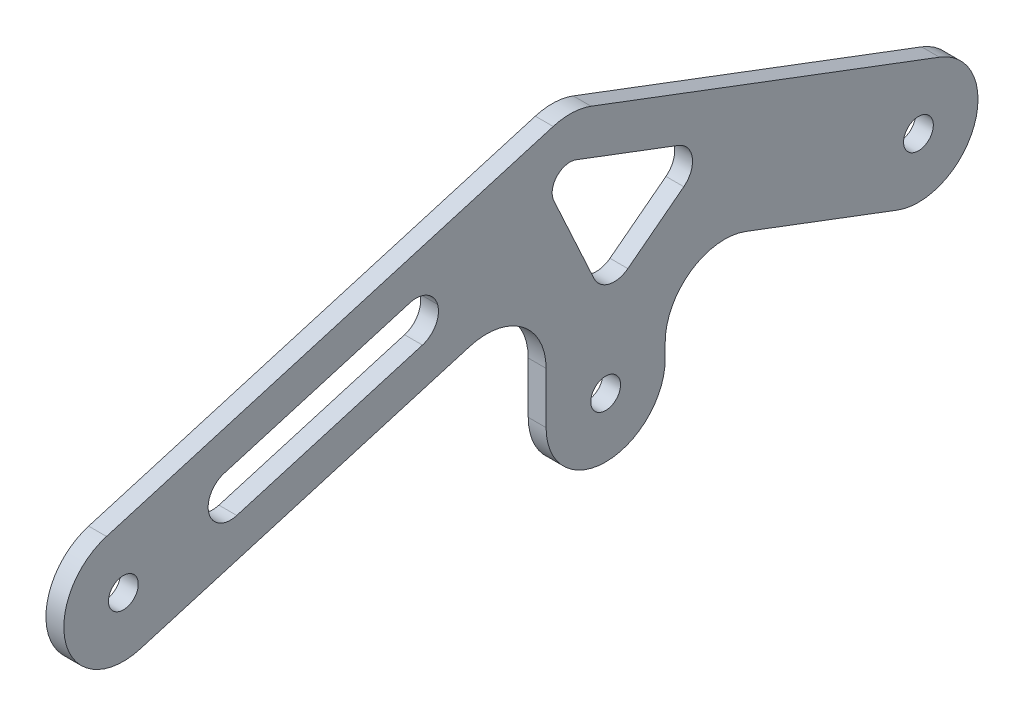
ISO-10303-21;
HEADER;
FILE_DESCRIPTION(('STEP AP214'),'2;1');
FILE_NAME('part.step','',(''),(''),'','','');
FILE_SCHEMA(('AUTOMOTIVE_DESIGN { 1 0 10303 214 1 1 1 1 }'));
ENDSEC;
DATA;
#1=APPLICATION_CONTEXT('core data for automotive mechanical design processes');
#2=APPLICATION_PROTOCOL_DEFINITION('international standard','automotive_design',2000,#1);
#3=PRODUCT_CONTEXT('',#1,'mechanical');
#4=PRODUCT('Part','Part','',(#3));
#5=PRODUCT_RELATED_PRODUCT_CATEGORY('part','',(#4));
#6=PRODUCT_DEFINITION_FORMATION('','',#4);
#7=PRODUCT_DEFINITION_CONTEXT('part definition',#1,'design');
#8=PRODUCT_DEFINITION('design','',#6,#7);
#9=PRODUCT_DEFINITION_SHAPE('','',#8);
#10=(LENGTH_UNIT() NAMED_UNIT(*) SI_UNIT(.MILLI.,.METRE.));
#11=(NAMED_UNIT(*) PLANE_ANGLE_UNIT() SI_UNIT($,.RADIAN.));
#12=(NAMED_UNIT(*) SI_UNIT($,.STERADIAN.) SOLID_ANGLE_UNIT());
#13=UNCERTAINTY_MEASURE_WITH_UNIT(LENGTH_MEASURE(1.E-05),#10,'distance_accuracy_value','');
#14=(GEOMETRIC_REPRESENTATION_CONTEXT(3) GLOBAL_UNCERTAINTY_ASSIGNED_CONTEXT((#13)) GLOBAL_UNIT_ASSIGNED_CONTEXT((#10,
#11,#12)) REPRESENTATION_CONTEXT('',''));
#15=CARTESIAN_POINT('',(0.,0.,0.));
#16=DIRECTION('',(0.,0.,1.));
#17=DIRECTION('',(1.,0.,0.));
#18=AXIS2_PLACEMENT_3D('',#15,#16,#17);
#19=CARTESIAN_POINT('',(3.,-1.49353266513425,-90.9802292545983));
#20=DIRECTION('',(1.,0.,0.));
#21=DIRECTION('',(0.,0.,-1.));
#22=AXIS2_PLACEMENT_3D('',#19,#20,#21);
#23=PLANE('',#22);
#24=CARTESIAN_POINT('',(3.,10.,-10.));
#25=DIRECTION('',(1.,0.,0.));
#26=DIRECTION('',(0.,0.,-1.));
#27=AXIS2_PLACEMENT_3D('',#24,#25,#26);
#28=CIRCLE('',#27,2.5);
#29=CARTESIAN_POINT('',(3.,10.,-12.5));
#30=VERTEX_POINT('',#29);
#31=EDGE_CURVE('E263',#30,#30,#28,.T.);
#32=ORIENTED_EDGE('',*,*,#31,.F.);
#33=EDGE_LOOP('',(#32));
#34=FACE_BOUND('',#33,.T.);
#35=DIRECTION('',(0.,0.282841783069722,-0.959166578728607));
#36=VECTOR('',#35,1.);
#37=CARTESIAN_POINT('',(3.,0.408334212721614,-12.8284178306949));
#38=LINE('',#37,#36);
#39=CARTESIAN_POINT('',(3.,0.408334212721614,-12.8284178306949));
#40=VERTEX_POINT('',#39);
#41=CARTESIAN_POINT('',(3.,16.7222546895087,-68.1518114239011));
#42=VERTEX_POINT('',#41);
#43=EDGE_CURVE('E300',#40,#42,#38,.T.);
#44=ORIENTED_EDGE('',*,*,#43,.T.);
#45=CARTESIAN_POINT('',(3.,7.13058890222264,-70.9802292545983));
#46=DIRECTION('',(1.,0.,0.));
#47=DIRECTION('',(0.,0.,-1.));
#48=AXIS2_PLACEMENT_3D('',#45,#46,#47);
#49=CIRCLE('',#48,10.);
#50=CARTESIAN_POINT('',(3.,7.13058890222264,-80.9802292545983));
#51=VERTEX_POINT('',#50);
#52=EDGE_CURVE('E235',#42,#51,#49,.F.);
#53=ORIENTED_EDGE('',*,*,#52,.T.);
#54=DIRECTION('',(0.,-1.,0.));
#55=VECTOR('',#54,1.);
#56=CARTESIAN_POINT('',(3.,20.5051352169009,-80.9802292545983));
#57=LINE('',#56,#55);
#58=CARTESIAN_POINT('',(3.,-1.49353266513425,-80.9802292545983));
#59=VERTEX_POINT('',#58);
#60=EDGE_CURVE('E271',#51,#59,#57,.T.);
#61=ORIENTED_EDGE('',*,*,#60,.T.);
#62=CARTESIAN_POINT('',(3.,-1.49353266513425,-90.9802292545983));
#63=DIRECTION('',(1.,0.,0.));
#64=DIRECTION('',(0.,0.,-1.));
#65=AXIS2_PLACEMENT_3D('',#62,#63,#64);
#66=CIRCLE('',#65,9.99999999999999);
#67=CARTESIAN_POINT('',(3.,-1.49353266513425,-100.980229254598));
#68=VERTEX_POINT('',#67);
#69=EDGE_CURVE('E274',#59,#68,#66,.T.);
#70=ORIENTED_EDGE('',*,*,#69,.T.);
#71=DIRECTION('',(0.,1.,0.));
#72=VECTOR('',#71,1.);
#73=CARTESIAN_POINT('',(3.,15.3840401127578,-100.980229254598));
#74=LINE('',#73,#72);
#75=CARTESIAN_POINT('',(3.,0.912721051605862,-100.980229254598));
#76=VERTEX_POINT('',#75);
#77=EDGE_CURVE('E278',#68,#76,#74,.T.);
#78=ORIENTED_EDGE('',*,*,#77,.T.);
#79=CARTESIAN_POINT('',(3.,0.912721051605853,-110.980229254598));
#80=DIRECTION('',(1.,0.,0.));
#81=DIRECTION('',(0.,0.,-1.));
#82=AXIS2_PLACEMENT_3D('',#79,#80,#81);
#83=CIRCLE('',#82,10.);
#84=CARTESIAN_POINT('',(3.,10.2665846063096,-114.516503650058));
#85=VERTEX_POINT('',#84);
#86=EDGE_CURVE('E383',#76,#85,#83,.F.);
#87=ORIENTED_EDGE('',*,*,#86,.T.);
#88=DIRECTION('',(0.,-0.353627439545988,-0.935386355470374));
#89=VECTOR('',#88,1.);
#90=CARTESIAN_POINT('',(3.,15.3840401127578,-100.980229254598));
#91=LINE('',#90,#89);
#92=CARTESIAN_POINT('',(3.,0.64613644529626,-139.96372560454));
#93=VERTEX_POINT('',#92);
#94=EDGE_CURVE('E282',#85,#93,#91,.T.);
#95=ORIENTED_EDGE('',*,*,#94,.T.);
#96=CARTESIAN_POINT('',(3.,10.,-143.5));
#97=DIRECTION('',(1.,0.,0.));
#98=DIRECTION('',(0.,0.,-1.));
#99=AXIS2_PLACEMENT_3D('',#96,#97,#98);
#100=CIRCLE('',#99,10.);
#101=CARTESIAN_POINT('',(3.,19.3538635547037,-147.03627439546));
#102=VERTEX_POINT('',#101);
#103=EDGE_CURVE('E285',#93,#102,#100,.T.);
#104=ORIENTED_EDGE('',*,*,#103,.T.);
#105=DIRECTION('',(0.,0.353627439545988,0.935386355470374));
#106=VECTOR('',#105,1.);
#107=CARTESIAN_POINT('',(3.,19.3538635547037,-147.03627439546));
#108=LINE('',#107,#106);
#109=CARTESIAN_POINT('',(3.,41.4700779857315,-88.5362743954599));
#110=VERTEX_POINT('',#109);
#111=EDGE_CURVE('E288',#102,#110,#108,.T.);
#112=ORIENTED_EDGE('',*,*,#111,.T.);
#113=CARTESIAN_POINT('',(3.,32.1162144310277,-85.));
#114=DIRECTION('',(1.,0.,0.));
#115=DIRECTION('',(0.,0.,-1.));
#116=AXIS2_PLACEMENT_3D('',#113,#114,#115);
#117=CIRCLE('',#116,9.99999999999999);
#118=CARTESIAN_POINT('',(3.,41.7078802183132,-82.1715821693008));
#119=VERTEX_POINT('',#118);
#120=EDGE_CURVE('E291',#110,#119,#117,.T.);
#121=ORIENTED_EDGE('',*,*,#120,.T.);
#122=DIRECTION('',(0.,-0.282841783069918,0.959166578728549));
#123=VECTOR('',#122,1.);
#124=CARTESIAN_POINT('',(3.,19.5916657872778,-7.17158216930308));
#125=LINE('',#124,#123);
#126=CARTESIAN_POINT('',(3.,19.5916657872778,-7.17158216930308));
#127=VERTEX_POINT('',#126);
#128=EDGE_CURVE('E294',#119,#127,#125,.T.);
#129=ORIENTED_EDGE('',*,*,#128,.T.);
#130=CARTESIAN_POINT('',(3.,10.,-10.));
#131=DIRECTION('',(1.,0.,0.));
#132=DIRECTION('',(0.,0.,-1.));
#133=AXIS2_PLACEMENT_3D('',#130,#131,#132);
#134=CIRCLE('',#133,9.99999999999199);
#135=EDGE_CURVE('E297',#127,#40,#134,.T.);
#136=ORIENTED_EDGE('',*,*,#135,.T.);
#137=EDGE_LOOP('',(#44,#53,#61,#70,#78,#87,#95,#104,#112,#121,#129,#136));
#138=FACE_BOUND('',#137,.T.);
#139=CARTESIAN_POINT('',(3.,10.,-143.5));
#140=DIRECTION('',(1.,0.,0.));
#141=DIRECTION('',(0.,0.,-1.));
#142=AXIS2_PLACEMENT_3D('',#139,#140,#141);
#143=CIRCLE('',#142,2.5);
#144=CARTESIAN_POINT('',(3.,10.,-146.));
#145=VERTEX_POINT('',#144);
#146=EDGE_CURVE('E255',#145,#145,#143,.T.);
#147=ORIENTED_EDGE('',*,*,#146,.F.);
#148=EDGE_LOOP('',(#147));
#149=FACE_BOUND('',#148,.T.);
#150=CARTESIAN_POINT('',(3.,-1.49353266513425,-90.9802292545983));
#151=DIRECTION('',(1.,0.,0.));
#152=DIRECTION('',(0.,0.,-1.));
#153=AXIS2_PLACEMENT_3D('',#150,#151,#152);
#154=CIRCLE('',#153,2.49999999999999);
#155=CARTESIAN_POINT('',(3.,-1.49353266513425,-93.4802292545983));
#156=VERTEX_POINT('',#155);
#157=EDGE_CURVE('E242',#156,#156,#154,.T.);
#158=ORIENTED_EDGE('',*,*,#157,.F.);
#159=EDGE_LOOP('',(#158));
#160=FACE_BOUND('',#159,.T.);
#161=DIRECTION('',(0.,-0.353627439545988,-0.935386355470374));
#162=VECTOR('',#161,1.);
#163=CARTESIAN_POINT('',(3.,28.741265144375,-102.410644154323));
#164=LINE('',#163,#162);
#165=CARTESIAN_POINT('',(3.,34.9223734974389,-86.060882318638));
#166=VERTEX_POINT('',#165);
#167=CARTESIAN_POINT('',(3.,28.4635451329216,-103.145246394715));
#168=VERTEX_POINT('',#167);
#169=EDGE_CURVE('E229',#166,#168,#164,.T.);
#170=ORIENTED_EDGE('',*,*,#169,.T.);
#171=CARTESIAN_POINT('',(3.,24.9558462999077,-101.819143496417));
#172=DIRECTION('',(1.,0.,0.));
#173=DIRECTION('',(0.,0.,-1.));
#174=AXIS2_PLACEMENT_3D('',#171,#172,#173);
#175=CIRCLE('',#174,3.75);
#176=CARTESIAN_POINT('',(3.,21.9809519676192,-104.102234320655));
#177=VERTEX_POINT('',#176);
#178=EDGE_CURVE('E429',#168,#177,#175,.F.);
#179=ORIENTED_EDGE('',*,*,#178,.T.);
#180=DIRECTION('',(0.,-0.608824219796667,0.793305155276946));
#181=VECTOR('',#180,1.);
#182=CARTESIAN_POINT('',(3.,6.94202628156058,-84.5063363773015));
#183=LINE('',#182,#181);
#184=CARTESIAN_POINT('',(3.,14.7720847878221,-94.7089951697061));
#185=VERTEX_POINT('',#184);
#186=EDGE_CURVE('E476',#177,#185,#183,.T.);
#187=ORIENTED_EDGE('',*,*,#186,.T.);
#188=CARTESIAN_POINT('',(3.,17.7469791201106,-92.4259043454686));
#189=DIRECTION('',(1.,0.,0.));
#190=DIRECTION('',(0.,0.,-1.));
#191=AXIS2_PLACEMENT_3D('',#188,#189,#190);
#192=CIRCLE('',#191,3.75);
#193=CARTESIAN_POINT('',(3.,16.1816510353007,-89.0182294802702));
#194=VERTEX_POINT('',#193);
#195=EDGE_CURVE('E424',#185,#194,#192,.F.);
#196=ORIENTED_EDGE('',*,*,#195,.T.);
#197=DIRECTION('',(0.,0.908713297386252,0.417420822615985));
#198=VECTOR('',#197,1.);
#199=CARTESIAN_POINT('',(3.,0.84197625683953,-96.064565968472));
#200=LINE('',#199,#198);
#201=CARTESIAN_POINT('',(3.,30.8639519631798,-82.2738601078412));
#202=VERTEX_POINT('',#201);
#203=EDGE_CURVE('E484',#194,#202,#200,.T.);
#204=ORIENTED_EDGE('',*,*,#203,.T.);
#205=CARTESIAN_POINT('',(3.,32.1162144310277,-85.));
#206=DIRECTION('',(1.,0.,0.));
#207=DIRECTION('',(0.,0.,-1.));
#208=AXIS2_PLACEMENT_3D('',#205,#206,#207);
#209=CIRCLE('',#208,3.00000000000001);
#210=EDGE_CURVE('E241',#166,#202,#209,.T.);
#211=ORIENTED_EDGE('',*,*,#210,.F.);
#212=EDGE_LOOP('',(#170,#179,#187,#196,#204,#211));
#213=FACE_BOUND('',#212,.T.);
#214=CARTESIAN_POINT('',(3.,24.4956413823256,-59.1572871598404));
#215=DIRECTION('',(1.,0.,0.));
#216=DIRECTION('',(0.,0.,-1.));
#217=AXIS2_PLACEMENT_3D('',#214,#215,#216);
#218=CIRCLE('',#217,3.75);
#219=CARTESIAN_POINT('',(3.,28.0925160525577,-58.0966304733282));
#220=VERTEX_POINT('',#219);
#221=CARTESIAN_POINT('',(3.,25.5562980688378,-62.7541618300724));
#222=VERTEX_POINT('',#221);
#223=EDGE_CURVE('E435',#220,#222,#218,.F.);
#224=ORIENTED_EDGE('',*,*,#223,.T.);
#225=CARTESIAN_POINT('',(3.,24.4956413823256,-59.1572871598404));
#226=DIRECTION('',(1.,0.,0.));
#227=DIRECTION('',(0.,0.,-1.));
#228=AXIS2_PLACEMENT_3D('',#225,#226,#227);
#229=CIRCLE('',#228,3.75);
#230=CARTESIAN_POINT('',(3.,20.8987667120936,-60.2179438463526));
#231=VERTEX_POINT('',#230);
#232=EDGE_CURVE('E441',#222,#231,#229,.F.);
#233=ORIENTED_EDGE('',*,*,#232,.T.);
#234=DIRECTION('',(0.,-0.282841783069918,0.959166578728549));
#235=VECTOR('',#234,1.);
#236=CARTESIAN_POINT('',(3.,27.4529683230725,-82.4444022828199));
#237=LINE('',#236,#235);
#238=CARTESIAN_POINT('',(3.,11.7064087623212,-29.0450300376748));
#239=VERTEX_POINT('',#238);
#240=EDGE_CURVE('E475',#231,#239,#237,.T.);
#241=ORIENTED_EDGE('',*,*,#240,.T.);
#242=CARTESIAN_POINT('',(3.,15.3032834325533,-27.9843733511626));
#243=DIRECTION('',(1.,0.,0.));
#244=DIRECTION('',(0.,0.,-1.));
#245=AXIS2_PLACEMENT_3D('',#242,#243,#244);
#246=CIRCLE('',#245,3.75);
#247=CARTESIAN_POINT('',(3.,14.2426267460411,-24.3874986809305));
#248=VERTEX_POINT('',#247);
#249=EDGE_CURVE('E64',#239,#248,#246,.F.);
#250=ORIENTED_EDGE('',*,*,#249,.T.);
#251=CARTESIAN_POINT('',(3.,15.3032834325533,-27.9843733511625));
#252=DIRECTION('',(1.,0.,0.));
#253=DIRECTION('',(0.,0.,-1.));
#254=AXIS2_PLACEMENT_3D('',#251,#252,#253);
#255=CIRCLE('',#254,3.75);
#256=CARTESIAN_POINT('',(3.,18.9001581027853,-26.9237166646504));
#257=VERTEX_POINT('',#256);
#258=EDGE_CURVE('E11',#248,#257,#255,.F.);
#259=ORIENTED_EDGE('',*,*,#258,.T.);
#260=DIRECTION('',(0.,0.282841783069918,-0.959166578728549));
#261=VECTOR('',#260,1.);
#262=CARTESIAN_POINT('',(3.,34.6467176635366,-80.3230889097955));
#263=LINE('',#262,#261);
#264=EDGE_CURVE('E469',#257,#220,#263,.T.);
#265=ORIENTED_EDGE('',*,*,#264,.T.);
#266=EDGE_LOOP('',(#224,#233,#241,#250,#259,#265));
#267=FACE_BOUND('',#266,.T.);
#268=ADVANCED_FACE('F47',(#34,#138,#149,#160,#213,#267),#23,.T.);
#269=CARTESIAN_POINT('',(0.,-1.49353266513425,-90.9802292545983));
#270=DIRECTION('',(1.,0.,0.));
#271=DIRECTION('',(0.,0.,-1.));
#272=AXIS2_PLACEMENT_3D('',#269,#270,#271);
#273=PLANE('',#272);
#274=DIRECTION('',(0.,-0.908713297386252,-0.417420822615985));
#275=VECTOR('',#274,1.);
#276=CARTESIAN_POINT('',(0.,11.9104331472534,-90.9802292545983));
#277=LINE('',#276,#275);
#278=CARTESIAN_POINT('',(0.,30.8639519631798,-82.2738601078412));
#279=VERTEX_POINT('',#278);
#280=CARTESIAN_POINT('',(0.,16.1816510353007,-89.0182294802702));
#281=VERTEX_POINT('',#280);
#282=EDGE_CURVE('E841',#279,#281,#277,.T.);
#283=ORIENTED_EDGE('',*,*,#282,.T.);
#284=CARTESIAN_POINT('',(0.,17.7469791201106,-92.4259043454686));
#285=DIRECTION('',(1.,0.,0.));
#286=DIRECTION('',(0.,0.,-1.));
#287=AXIS2_PLACEMENT_3D('',#284,#285,#286);
#288=CIRCLE('',#287,3.75);
#289=CARTESIAN_POINT('',(0.,14.7720847878221,-94.7089951697061));
#290=VERTEX_POINT('',#289);
#291=EDGE_CURVE('E421',#281,#290,#288,.T.);
#292=ORIENTED_EDGE('',*,*,#291,.T.);
#293=DIRECTION('',(0.,0.608824219796667,-0.793305155276946));
#294=VECTOR('',#293,1.);
#295=CARTESIAN_POINT('',(0.,26.0816875087892,-109.445541205397));
#296=LINE('',#295,#294);
#297=CARTESIAN_POINT('',(0.,21.9809519676192,-104.102234320655));
#298=VERTEX_POINT('',#297);
#299=EDGE_CURVE('E222',#290,#298,#296,.T.);
#300=ORIENTED_EDGE('',*,*,#299,.T.);
#301=CARTESIAN_POINT('',(0.,24.9558462999077,-101.819143496417));
#302=DIRECTION('',(1.,0.,0.));
#303=DIRECTION('',(0.,0.,-1.));
#304=AXIS2_PLACEMENT_3D('',#301,#302,#303);
#305=CIRCLE('',#304,3.75);
#306=CARTESIAN_POINT('',(0.,28.4635451329216,-103.145246394715));
#307=VERTEX_POINT('',#306);
#308=EDGE_CURVE('E218',#298,#307,#305,.T.);
#309=ORIENTED_EDGE('',*,*,#308,.T.);
#310=DIRECTION('',(0.,0.353627439545988,0.935386355470374));
#311=VECTOR('',#310,1.);
#312=CARTESIAN_POINT('',(0.,34.9223734974389,-86.060882318638));
#313=LINE('',#312,#311);
#314=CARTESIAN_POINT('',(0.,34.9223734974389,-86.060882318638));
#315=VERTEX_POINT('',#314);
#316=EDGE_CURVE('E210',#307,#315,#313,.T.);
#317=ORIENTED_EDGE('',*,*,#316,.T.);
#318=CARTESIAN_POINT('',(0.,32.1162144310277,-85.));
#319=DIRECTION('',(1.,0.,0.));
#320=DIRECTION('',(0.,0.,-1.));
#321=AXIS2_PLACEMENT_3D('',#318,#319,#320);
#322=CIRCLE('',#321,3.00000000000001);
#323=EDGE_CURVE('E216',#315,#279,#322,.T.);
#324=ORIENTED_EDGE('',*,*,#323,.T.);
#325=EDGE_LOOP('',(#283,#292,#300,#309,#317,#324));
#326=FACE_BOUND('',#325,.T.);
#327=DIRECTION('',(0.,-1.,0.));
#328=VECTOR('',#327,1.);
#329=CARTESIAN_POINT('',(0.,20.5051352169009,-80.9802292545983));
#330=LINE('',#329,#328);
#331=CARTESIAN_POINT('',(0.,7.13058890222264,-80.9802292545983));
#332=VERTEX_POINT('',#331);
#333=CARTESIAN_POINT('',(0.,-1.49353266513425,-80.9802292545983));
#334=VERTEX_POINT('',#333);
#335=EDGE_CURVE('E267',#332,#334,#330,.T.);
#336=ORIENTED_EDGE('',*,*,#335,.F.);
#337=CARTESIAN_POINT('',(0.,7.13058890222264,-70.9802292545983));
#338=DIRECTION('',(1.,0.,0.));
#339=DIRECTION('',(0.,0.,-1.));
#340=AXIS2_PLACEMENT_3D('',#337,#338,#339);
#341=CIRCLE('',#340,10.);
#342=CARTESIAN_POINT('',(0.,16.7222546895087,-68.1518114239011));
#343=VERTEX_POINT('',#342);
#344=EDGE_CURVE('E386',#332,#343,#341,.T.);
#345=ORIENTED_EDGE('',*,*,#344,.T.);
#346=DIRECTION('',(0.,0.282841783069722,-0.959166578728607));
#347=VECTOR('',#346,1.);
#348=CARTESIAN_POINT('',(0.,0.408334212721614,-12.8284178306949));
#349=LINE('',#348,#347);
#350=CARTESIAN_POINT('',(0.,0.408334212721614,-12.8284178306949));
#351=VERTEX_POINT('',#350);
#352=EDGE_CURVE('E275',#351,#343,#349,.T.);
#353=ORIENTED_EDGE('',*,*,#352,.F.);
#354=CARTESIAN_POINT('',(0.,10.,-10.));
#355=DIRECTION('',(1.,0.,0.));
#356=DIRECTION('',(0.,0.,-1.));
#357=AXIS2_PLACEMENT_3D('',#354,#355,#356);
#358=CIRCLE('',#357,9.99999999999199);
#359=CARTESIAN_POINT('',(0.,19.5916657872778,-7.17158216930308));
#360=VERTEX_POINT('',#359);
#361=EDGE_CURVE('E329',#360,#351,#358,.T.);
#362=ORIENTED_EDGE('',*,*,#361,.F.);
#363=DIRECTION('',(0.,-0.282841783069918,0.959166578728549));
#364=VECTOR('',#363,1.);
#365=CARTESIAN_POINT('',(0.,19.5916657872778,-7.17158216930308));
#366=LINE('',#365,#364);
#367=CARTESIAN_POINT('',(0.,41.7078802183132,-82.1715821693008));
#368=VERTEX_POINT('',#367);
#369=EDGE_CURVE('E326',#368,#360,#366,.T.);
#370=ORIENTED_EDGE('',*,*,#369,.F.);
#371=CARTESIAN_POINT('',(0.,32.1162144310277,-85.));
#372=DIRECTION('',(1.,0.,0.));
#373=DIRECTION('',(0.,0.,-1.));
#374=AXIS2_PLACEMENT_3D('',#371,#372,#373);
#375=CIRCLE('',#374,9.99999999999999);
#376=CARTESIAN_POINT('',(0.,41.4700779857315,-88.5362743954599));
#377=VERTEX_POINT('',#376);
#378=EDGE_CURVE('E323',#377,#368,#375,.T.);
#379=ORIENTED_EDGE('',*,*,#378,.F.);
#380=DIRECTION('',(0.,0.353627439545988,0.935386355470374));
#381=VECTOR('',#380,1.);
#382=CARTESIAN_POINT('',(0.,19.3538635547037,-147.03627439546));
#383=LINE('',#382,#381);
#384=CARTESIAN_POINT('',(0.,19.3538635547037,-147.03627439546));
#385=VERTEX_POINT('',#384);
#386=EDGE_CURVE('E320',#385,#377,#383,.T.);
#387=ORIENTED_EDGE('',*,*,#386,.F.);
#388=CARTESIAN_POINT('',(0.,10.,-143.5));
#389=DIRECTION('',(1.,0.,0.));
#390=DIRECTION('',(0.,0.,-1.));
#391=AXIS2_PLACEMENT_3D('',#388,#389,#390);
#392=CIRCLE('',#391,10.);
#393=CARTESIAN_POINT('',(0.,0.64613644529626,-139.96372560454));
#394=VERTEX_POINT('',#393);
#395=EDGE_CURVE('E317',#394,#385,#392,.T.);
#396=ORIENTED_EDGE('',*,*,#395,.F.);
#397=DIRECTION('',(0.,-0.353627439545988,-0.935386355470374));
#398=VECTOR('',#397,1.);
#399=CARTESIAN_POINT('',(0.,15.3840401127578,-100.980229254598));
#400=LINE('',#399,#398);
#401=CARTESIAN_POINT('',(0.,10.2665846063096,-114.516503650058));
#402=VERTEX_POINT('',#401);
#403=EDGE_CURVE('E314',#402,#394,#400,.T.);
#404=ORIENTED_EDGE('',*,*,#403,.F.);
#405=CARTESIAN_POINT('',(0.,0.912721051605853,-110.980229254598));
#406=DIRECTION('',(1.,0.,0.));
#407=DIRECTION('',(0.,0.,-1.));
#408=AXIS2_PLACEMENT_3D('',#405,#406,#407);
#409=CIRCLE('',#408,10.);
#410=CARTESIAN_POINT('',(0.,0.912721051605862,-100.980229254598));
#411=VERTEX_POINT('',#410);
#412=EDGE_CURVE('E380',#402,#411,#409,.T.);
#413=ORIENTED_EDGE('',*,*,#412,.T.);
#414=DIRECTION('',(0.,1.,0.));
#415=VECTOR('',#414,1.);
#416=CARTESIAN_POINT('',(0.,15.3840401127578,-100.980229254598));
#417=LINE('',#416,#415);
#418=CARTESIAN_POINT('',(0.,-1.49353266513425,-100.980229254598));
#419=VERTEX_POINT('',#418);
#420=EDGE_CURVE('E310',#419,#411,#417,.T.);
#421=ORIENTED_EDGE('',*,*,#420,.F.);
#422=CARTESIAN_POINT('',(0.,-1.49353266513425,-90.9802292545983));
#423=DIRECTION('',(1.,0.,0.));
#424=DIRECTION('',(0.,0.,-1.));
#425=AXIS2_PLACEMENT_3D('',#422,#423,#424);
#426=CIRCLE('',#425,9.99999999999999);
#427=EDGE_CURVE('E307',#334,#419,#426,.T.);
#428=ORIENTED_EDGE('',*,*,#427,.F.);
#429=EDGE_LOOP('',(#336,#345,#353,#362,#370,#379,#387,#396,#404,#413,#421,#428));
#430=FACE_BOUND('',#429,.T.);
#431=CARTESIAN_POINT('',(0.,10.,-10.));
#432=DIRECTION('',(1.,0.,0.));
#433=DIRECTION('',(0.,0.,-1.));
#434=AXIS2_PLACEMENT_3D('',#431,#432,#433);
#435=CIRCLE('',#434,2.5);
#436=CARTESIAN_POINT('',(0.,10.,-12.5));
#437=VERTEX_POINT('',#436);
#438=EDGE_CURVE('E259',#437,#437,#435,.T.);
#439=ORIENTED_EDGE('',*,*,#438,.T.);
#440=EDGE_LOOP('',(#439));
#441=FACE_BOUND('',#440,.T.);
#442=CARTESIAN_POINT('',(0.,10.,-143.5));
#443=DIRECTION('',(1.,0.,0.));
#444=DIRECTION('',(0.,0.,-1.));
#445=AXIS2_PLACEMENT_3D('',#442,#443,#444);
#446=CIRCLE('',#445,2.5);
#447=CARTESIAN_POINT('',(0.,10.,-146.));
#448=VERTEX_POINT('',#447);
#449=EDGE_CURVE('E248',#448,#448,#446,.T.);
#450=ORIENTED_EDGE('',*,*,#449,.T.);
#451=EDGE_LOOP('',(#450));
#452=FACE_BOUND('',#451,.T.);
#453=CARTESIAN_POINT('',(0.,-1.49353266513425,-90.9802292545983));
#454=DIRECTION('',(1.,0.,0.));
#455=DIRECTION('',(0.,0.,-1.));
#456=AXIS2_PLACEMENT_3D('',#453,#454,#455);
#457=CIRCLE('',#456,2.49999999999999);
#458=CARTESIAN_POINT('',(0.,-1.49353266513425,-93.4802292545983));
#459=VERTEX_POINT('',#458);
#460=EDGE_CURVE('E251',#459,#459,#457,.T.);
#461=ORIENTED_EDGE('',*,*,#460,.T.);
#462=EDGE_LOOP('',(#461));
#463=FACE_BOUND('',#462,.T.);
#464=DIRECTION('',(0.,-0.282841783069918,0.959166578728549));
#465=VECTOR('',#464,1.);
#466=CARTESIAN_POINT('',(0.,17.8395014162731,-23.3268419944183));
#467=LINE('',#466,#465);
#468=CARTESIAN_POINT('',(0.,28.0925160525577,-58.0966304733282));
#469=VERTEX_POINT('',#468);
#470=CARTESIAN_POINT('',(0.,18.9001581027853,-26.9237166646504));
#471=VERTEX_POINT('',#470);
#472=EDGE_CURVE('E854',#469,#471,#467,.T.);
#473=ORIENTED_EDGE('',*,*,#472,.T.);
#474=CARTESIAN_POINT('',(0.,15.3032834325533,-27.9843733511625));
#475=DIRECTION('',(1.,0.,0.));
#476=DIRECTION('',(0.,0.,-1.));
#477=AXIS2_PLACEMENT_3D('',#474,#475,#476);
#478=CIRCLE('',#477,3.75);
#479=CARTESIAN_POINT('',(0.,14.2426267460411,-24.3874986809305));
#480=VERTEX_POINT('',#479);
#481=EDGE_CURVE('E57',#471,#480,#478,.T.);
#482=ORIENTED_EDGE('',*,*,#481,.T.);
#483=CARTESIAN_POINT('',(0.,15.3032834325533,-27.9843733511626));
#484=DIRECTION('',(1.,0.,0.));
#485=DIRECTION('',(0.,0.,-1.));
#486=AXIS2_PLACEMENT_3D('',#483,#484,#485);
#487=CIRCLE('',#486,3.75);
#488=CARTESIAN_POINT('',(0.,11.7064087623212,-29.0450300376747));
#489=VERTEX_POINT('',#488);
#490=EDGE_CURVE('E444',#480,#489,#487,.T.);
#491=ORIENTED_EDGE('',*,*,#490,.T.);
#492=DIRECTION('',(0.,0.282841783069918,-0.959166578728549));
#493=VECTOR('',#492,1.);
#494=CARTESIAN_POINT('',(0.,21.9594233986058,-63.8148185165846));
#495=LINE('',#494,#493);
#496=CARTESIAN_POINT('',(0.,20.8987667120936,-60.2179438463526));
#497=VERTEX_POINT('',#496);
#498=EDGE_CURVE('E849',#489,#497,#495,.T.);
#499=ORIENTED_EDGE('',*,*,#498,.T.);
#500=CARTESIAN_POINT('',(0.,24.4956413823256,-59.1572871598404));
#501=DIRECTION('',(1.,0.,0.));
#502=DIRECTION('',(0.,0.,-1.));
#503=AXIS2_PLACEMENT_3D('',#500,#501,#502);
#504=CIRCLE('',#503,3.75);
#505=CARTESIAN_POINT('',(0.,25.5562980688378,-62.7541618300724));
#506=VERTEX_POINT('',#505);
#507=EDGE_CURVE('E438',#497,#506,#504,.T.);
#508=ORIENTED_EDGE('',*,*,#507,.T.);
#509=CARTESIAN_POINT('',(0.,24.4956413823256,-59.1572871598404));
#510=DIRECTION('',(1.,0.,0.));
#511=DIRECTION('',(0.,0.,-1.));
#512=AXIS2_PLACEMENT_3D('',#509,#510,#511);
#513=CIRCLE('',#512,3.75);
#514=EDGE_CURVE('E432',#506,#469,#513,.T.);
#515=ORIENTED_EDGE('',*,*,#514,.T.);
#516=EDGE_LOOP('',(#473,#482,#491,#499,#508,#515));
#517=FACE_BOUND('',#516,.T.);
#518=ADVANCED_FACE('F213',(#326,#430,#441,#452,#463,#517),#273,.F.);
#519=CARTESIAN_POINT('',(3.,32.1162144310277,-85.));
#520=DIRECTION('',(-1.,0.,0.));
#521=DIRECTION('',(0.,0.,1.));
#522=AXIS2_PLACEMENT_3D('',#519,#520,#521);
#523=CYLINDRICAL_SURFACE('',#522,3.00000000000001);
#524=ORIENTED_EDGE('',*,*,#210,.T.);
#525=DIRECTION('',(-1.,0.,0.));
#526=VECTOR('',#525,1.);
#527=CARTESIAN_POINT('',(3.,30.8639519631798,-82.2738601078412));
#528=LINE('',#527,#526);
#529=EDGE_CURVE('E234',#202,#279,#528,.T.);
#530=ORIENTED_EDGE('',*,*,#529,.T.);
#531=ORIENTED_EDGE('',*,*,#323,.F.);
#532=DIRECTION('',(-1.,0.,0.));
#533=VECTOR('',#532,1.);
#534=CARTESIAN_POINT('',(3.,34.9223734974389,-86.060882318638));
#535=LINE('',#534,#533);
#536=EDGE_CURVE('E226',#166,#315,#535,.T.);
#537=ORIENTED_EDGE('',*,*,#536,.F.);
#538=EDGE_LOOP('',(#524,#530,#531,#537));
#539=FACE_BOUND('',#538,.T.);
#540=ADVANCED_FACE('F238',(#539),#523,.F.);
#541=CARTESIAN_POINT('',(3.,20.5051352169009,-80.9802292545983));
#542=DIRECTION('',(0.,0.,-1.));
#543=DIRECTION('',(-1.,0.,0.));
#544=AXIS2_PLACEMENT_3D('',#541,#542,#543);
#545=PLANE('',#544);
#546=ORIENTED_EDGE('',*,*,#60,.F.);
#547=DIRECTION('',(-1.,0.,0.));
#548=VECTOR('',#547,1.);
#549=CARTESIAN_POINT('',(0.,7.13058890222264,-80.9802292545983));
#550=LINE('',#549,#548);
#551=EDGE_CURVE('E373',#51,#332,#550,.T.);
#552=ORIENTED_EDGE('',*,*,#551,.T.);
#553=ORIENTED_EDGE('',*,*,#335,.T.);
#554=DIRECTION('',(-1.,0.,0.));
#555=VECTOR('',#554,1.);
#556=CARTESIAN_POINT('',(3.,-1.49353266513425,-80.9802292545983));
#557=LINE('',#556,#555);
#558=EDGE_CURVE('E362',#59,#334,#557,.T.);
#559=ORIENTED_EDGE('',*,*,#558,.F.);
#560=EDGE_LOOP('',(#546,#552,#553,#559));
#561=FACE_BOUND('',#560,.T.);
#562=ADVANCED_FACE('F558',(#561),#545,.F.);
#563=CARTESIAN_POINT('',(3.,-1.49353266513425,-90.9802292545983));
#564=DIRECTION('',(-1.,0.,0.));
#565=DIRECTION('',(0.,0.,1.));
#566=AXIS2_PLACEMENT_3D('',#563,#564,#565);
#567=CYLINDRICAL_SURFACE('',#566,9.99999999999999);
#568=ORIENTED_EDGE('',*,*,#427,.T.);
#569=DIRECTION('',(-1.,0.,0.));
#570=VECTOR('',#569,1.);
#571=CARTESIAN_POINT('',(3.,-1.49353266513425,-100.980229254598));
#572=LINE('',#571,#570);
#573=EDGE_CURVE('E358',#68,#419,#572,.T.);
#574=ORIENTED_EDGE('',*,*,#573,.F.);
#575=ORIENTED_EDGE('',*,*,#69,.F.);
#576=ORIENTED_EDGE('',*,*,#558,.T.);
#577=EDGE_LOOP('',(#568,#574,#575,#576));
#578=FACE_BOUND('',#577,.T.);
#579=ADVANCED_FACE('F554',(#578),#567,.T.);
#580=CARTESIAN_POINT('',(3.,15.3840401127578,-100.980229254598));
#581=DIRECTION('',(0.,0.,1.));
#582=DIRECTION('',(0.,-1.,0.));
#583=AXIS2_PLACEMENT_3D('',#580,#581,#582);
#584=PLANE('',#583);
#585=ORIENTED_EDGE('',*,*,#420,.T.);
#586=DIRECTION('',(-1.,0.,0.));
#587=VECTOR('',#586,1.);
#588=CARTESIAN_POINT('',(3.,0.912721051605861,-100.980229254598));
#589=LINE('',#588,#587);
#590=EDGE_CURVE('E370',#411,#76,#589,.F.);
#591=ORIENTED_EDGE('',*,*,#590,.T.);
#592=ORIENTED_EDGE('',*,*,#77,.F.);
#593=ORIENTED_EDGE('',*,*,#573,.T.);
#594=EDGE_LOOP('',(#585,#591,#592,#593));
#595=FACE_BOUND('',#594,.T.);
#596=ADVANCED_FACE('F550',(#595),#584,.F.);
#597=CARTESIAN_POINT('',(3.,15.3840401127578,-100.980229254598));
#598=DIRECTION('',(0.,0.935386355470374,-0.353627439545988));
#599=DIRECTION('',(0.,0.353627439545988,0.935386355470374));
#600=AXIS2_PLACEMENT_3D('',#597,#598,#599);
#601=PLANE('',#600);
#602=ORIENTED_EDGE('',*,*,#94,.F.);
#603=DIRECTION('',(-1.,0.,0.));
#604=VECTOR('',#603,1.);
#605=CARTESIAN_POINT('',(0.,10.2665846063096,-114.516503650058));
#606=LINE('',#605,#604);
#607=EDGE_CURVE('E366',#85,#402,#606,.T.);
#608=ORIENTED_EDGE('',*,*,#607,.T.);
#609=ORIENTED_EDGE('',*,*,#403,.T.);
#610=DIRECTION('',(-1.,0.,0.));
#611=VECTOR('',#610,1.);
#612=CARTESIAN_POINT('',(3.,0.64613644529626,-139.96372560454));
#613=LINE('',#612,#611);
#614=EDGE_CURVE('E354',#93,#394,#613,.T.);
#615=ORIENTED_EDGE('',*,*,#614,.F.);
#616=EDGE_LOOP('',(#602,#608,#609,#615));
#617=FACE_BOUND('',#616,.T.);
#618=ADVANCED_FACE('F546',(#617),#601,.F.);
#619=CARTESIAN_POINT('',(3.,10.,-143.5));
#620=DIRECTION('',(-1.,0.,0.));
#621=DIRECTION('',(0.,0.,1.));
#622=AXIS2_PLACEMENT_3D('',#619,#620,#621);
#623=CYLINDRICAL_SURFACE('',#622,10.);
#624=ORIENTED_EDGE('',*,*,#395,.T.);
#625=DIRECTION('',(-1.,0.,0.));
#626=VECTOR('',#625,1.);
#627=CARTESIAN_POINT('',(3.,19.3538635547037,-147.03627439546));
#628=LINE('',#627,#626);
#629=EDGE_CURVE('E350',#102,#385,#628,.T.);
#630=ORIENTED_EDGE('',*,*,#629,.F.);
#631=ORIENTED_EDGE('',*,*,#103,.F.);
#632=ORIENTED_EDGE('',*,*,#614,.T.);
#633=EDGE_LOOP('',(#624,#630,#631,#632));
#634=FACE_BOUND('',#633,.T.);
#635=ADVANCED_FACE('F542',(#634),#623,.T.);
#636=CARTESIAN_POINT('',(3.,19.3538635547037,-147.03627439546));
#637=DIRECTION('',(0.,-0.935386355470374,0.353627439545988));
#638=DIRECTION('',(0.,-0.353627439545988,-0.935386355470374));
#639=AXIS2_PLACEMENT_3D('',#636,#637,#638);
#640=PLANE('',#639);
#641=ORIENTED_EDGE('',*,*,#386,.T.);
#642=DIRECTION('',(-1.,0.,0.));
#643=VECTOR('',#642,1.);
#644=CARTESIAN_POINT('',(3.,41.4700779857315,-88.5362743954599));
#645=LINE('',#644,#643);
#646=EDGE_CURVE('E346',#110,#377,#645,.T.);
#647=ORIENTED_EDGE('',*,*,#646,.F.);
#648=ORIENTED_EDGE('',*,*,#111,.F.);
#649=ORIENTED_EDGE('',*,*,#629,.T.);
#650=EDGE_LOOP('',(#641,#647,#648,#649));
#651=FACE_BOUND('',#650,.T.);
#652=ADVANCED_FACE('F538',(#651),#640,.F.);
#653=CARTESIAN_POINT('',(3.,32.1162144310277,-85.));
#654=DIRECTION('',(-1.,0.,0.));
#655=DIRECTION('',(0.,0.,1.));
#656=AXIS2_PLACEMENT_3D('',#653,#654,#655);
#657=CYLINDRICAL_SURFACE('',#656,9.99999999999999);
#658=ORIENTED_EDGE('',*,*,#378,.T.);
#659=DIRECTION('',(-1.,0.,0.));
#660=VECTOR('',#659,1.);
#661=CARTESIAN_POINT('',(3.,41.7078802183132,-82.1715821693008));
#662=LINE('',#661,#660);
#663=EDGE_CURVE('E342',#119,#368,#662,.T.);
#664=ORIENTED_EDGE('',*,*,#663,.F.);
#665=ORIENTED_EDGE('',*,*,#120,.F.);
#666=ORIENTED_EDGE('',*,*,#646,.T.);
#667=EDGE_LOOP('',(#658,#664,#665,#666));
#668=FACE_BOUND('',#667,.T.);
#669=ADVANCED_FACE('F534',(#668),#657,.T.);
#670=CARTESIAN_POINT('',(3.,19.5916657872778,-7.17158216930308));
#671=DIRECTION('',(0.,-0.959166578728549,-0.282841783069918));
#672=DIRECTION('',(0.,0.282841783069918,-0.959166578728549));
#673=AXIS2_PLACEMENT_3D('',#670,#671,#672);
#674=PLANE('',#673);
#675=ORIENTED_EDGE('',*,*,#369,.T.);
#676=DIRECTION('',(-1.,0.,0.));
#677=VECTOR('',#676,1.);
#678=CARTESIAN_POINT('',(3.,19.5916657872778,-7.17158216930308));
#679=LINE('',#678,#677);
#680=EDGE_CURVE('E338',#127,#360,#679,.T.);
#681=ORIENTED_EDGE('',*,*,#680,.F.);
#682=ORIENTED_EDGE('',*,*,#128,.F.);
#683=ORIENTED_EDGE('',*,*,#663,.T.);
#684=EDGE_LOOP('',(#675,#681,#682,#683));
#685=FACE_BOUND('',#684,.T.);
#686=ADVANCED_FACE('F530',(#685),#674,.F.);
#687=CARTESIAN_POINT('',(3.,10.,-10.));
#688=DIRECTION('',(-1.,0.,0.));
#689=DIRECTION('',(0.,0.,1.));
#690=AXIS2_PLACEMENT_3D('',#687,#688,#689);
#691=CYLINDRICAL_SURFACE('',#690,9.99999999999199);
#692=ORIENTED_EDGE('',*,*,#361,.T.);
#693=DIRECTION('',(-1.,0.,0.));
#694=VECTOR('',#693,1.);
#695=CARTESIAN_POINT('',(3.,0.408334212721614,-12.8284178306949));
#696=LINE('',#695,#694);
#697=EDGE_CURVE('E304',#40,#351,#696,.T.);
#698=ORIENTED_EDGE('',*,*,#697,.F.);
#699=ORIENTED_EDGE('',*,*,#135,.F.);
#700=ORIENTED_EDGE('',*,*,#680,.T.);
#701=EDGE_LOOP('',(#692,#698,#699,#700));
#702=FACE_BOUND('',#701,.T.);
#703=ADVANCED_FACE('F526',(#702),#691,.T.);
#704=CARTESIAN_POINT('',(3.,0.408334212721614,-12.8284178306949));
#705=DIRECTION('',(0.,0.959166578728607,0.282841783069722));
#706=DIRECTION('',(0.,-0.282841783069722,0.959166578728607));
#707=AXIS2_PLACEMENT_3D('',#704,#705,#706);
#708=PLANE('',#707);
#709=ORIENTED_EDGE('',*,*,#352,.T.);
#710=DIRECTION('',(-1.,0.,0.));
#711=VECTOR('',#710,1.);
#712=CARTESIAN_POINT('',(3.,16.7222546895087,-68.1518114239011));
#713=LINE('',#712,#711);
#714=EDGE_CURVE('E377',#343,#42,#713,.F.);
#715=ORIENTED_EDGE('',*,*,#714,.T.);
#716=ORIENTED_EDGE('',*,*,#43,.F.);
#717=ORIENTED_EDGE('',*,*,#697,.T.);
#718=EDGE_LOOP('',(#709,#715,#716,#717));
#719=FACE_BOUND('',#718,.T.);
#720=ADVANCED_FACE('F523',(#719),#708,.F.);
#721=CARTESIAN_POINT('',(3.,10.,-10.));
#722=DIRECTION('',(-1.,0.,0.));
#723=DIRECTION('',(0.,0.,1.));
#724=AXIS2_PLACEMENT_3D('',#721,#722,#723);
#725=CYLINDRICAL_SURFACE('',#724,2.5);
#726=ORIENTED_EDGE('',*,*,#31,.T.);
#727=EDGE_LOOP('',(#726));
#728=FACE_BOUND('',#727,.T.);
#729=ORIENTED_EDGE('',*,*,#438,.F.);
#730=EDGE_LOOP('',(#729));
#731=FACE_BOUND('',#730,.T.);
#732=ADVANCED_FACE('F507',(#728,#731),#725,.F.);
#733=CARTESIAN_POINT('',(3.,10.,-143.5));
#734=DIRECTION('',(-1.,0.,0.));
#735=DIRECTION('',(0.,0.,1.));
#736=AXIS2_PLACEMENT_3D('',#733,#734,#735);
#737=CYLINDRICAL_SURFACE('',#736,2.5);
#738=ORIENTED_EDGE('',*,*,#146,.T.);
#739=EDGE_LOOP('',(#738));
#740=FACE_BOUND('',#739,.T.);
#741=ORIENTED_EDGE('',*,*,#449,.F.);
#742=EDGE_LOOP('',(#741));
#743=FACE_BOUND('',#742,.T.);
#744=ADVANCED_FACE('F497',(#740,#743),#737,.F.);
#745=CARTESIAN_POINT('',(3.,-1.49353266513425,-90.9802292545983));
#746=DIRECTION('',(-1.,0.,0.));
#747=DIRECTION('',(0.,0.,1.));
#748=AXIS2_PLACEMENT_3D('',#745,#746,#747);
#749=CYLINDRICAL_SURFACE('',#748,2.49999999999999);
#750=ORIENTED_EDGE('',*,*,#157,.T.);
#751=EDGE_LOOP('',(#750));
#752=FACE_BOUND('',#751,.T.);
#753=ORIENTED_EDGE('',*,*,#460,.F.);
#754=EDGE_LOOP('',(#753));
#755=FACE_BOUND('',#754,.T.);
#756=ADVANCED_FACE('F494',(#752,#755),#749,.F.);
#757=CARTESIAN_POINT('',(3.,0.912721051605853,-110.980229254598));
#758=DIRECTION('',(1.,0.,0.));
#759=DIRECTION('',(0.,0.,-1.));
#760=AXIS2_PLACEMENT_3D('',#757,#758,#759);
#761=CYLINDRICAL_SURFACE('',#760,10.);
#762=ORIENTED_EDGE('',*,*,#86,.F.);
#763=ORIENTED_EDGE('',*,*,#590,.F.);
#764=ORIENTED_EDGE('',*,*,#412,.F.);
#765=ORIENTED_EDGE('',*,*,#607,.F.);
#766=EDGE_LOOP('',(#762,#763,#764,#765));
#767=FACE_BOUND('',#766,.T.);
#768=ADVANCED_FACE('F496',(#767),#761,.F.);
#769=CARTESIAN_POINT('',(3.,7.13058890222264,-70.9802292545983));
#770=DIRECTION('',(1.,0.,0.));
#771=DIRECTION('',(0.,0.,-1.));
#772=AXIS2_PLACEMENT_3D('',#769,#770,#771);
#773=CYLINDRICAL_SURFACE('',#772,10.);
#774=ORIENTED_EDGE('',*,*,#52,.F.);
#775=ORIENTED_EDGE('',*,*,#714,.F.);
#776=ORIENTED_EDGE('',*,*,#344,.F.);
#777=ORIENTED_EDGE('',*,*,#551,.F.);
#778=EDGE_LOOP('',(#774,#775,#776,#777));
#779=FACE_BOUND('',#778,.T.);
#780=ADVANCED_FACE('F504',(#779),#773,.F.);
#781=CARTESIAN_POINT('',(10.,11.9104331472534,-90.9802292545983));
#782=DIRECTION('',(0.,0.417420822615985,-0.908713297386252));
#783=DIRECTION('',(0.,0.908713297386252,0.417420822615985));
#784=AXIS2_PLACEMENT_3D('',#781,#782,#783);
#785=PLANE('',#784);
#786=ORIENTED_EDGE('',*,*,#203,.F.);
#787=DIRECTION('',(-1.,0.,0.));
#788=VECTOR('',#787,1.);
#789=CARTESIAN_POINT('',(0.,16.1816510353007,-89.0182294802702));
#790=LINE('',#789,#788);
#791=EDGE_CURVE('E393',#194,#281,#790,.T.);
#792=ORIENTED_EDGE('',*,*,#791,.T.);
#793=ORIENTED_EDGE('',*,*,#282,.F.);
#794=ORIENTED_EDGE('',*,*,#529,.F.);
#795=EDGE_LOOP('',(#786,#792,#793,#794));
#796=FACE_BOUND('',#795,.T.);
#797=ADVANCED_FACE('F565',(#796),#785,.T.);
#798=CARTESIAN_POINT('',(10.,26.0816875087892,-109.445541205397));
#799=DIRECTION('',(0.,0.793305155276946,0.608824219796667));
#800=DIRECTION('',(0.,-0.608824219796667,0.793305155276946));
#801=AXIS2_PLACEMENT_3D('',#798,#799,#800);
#802=PLANE('',#801);
#803=ORIENTED_EDGE('',*,*,#299,.F.);
#804=DIRECTION('',(-1.,0.,0.));
#805=VECTOR('',#804,1.);
#806=CARTESIAN_POINT('',(3.,14.7720847878221,-94.7089951697061));
#807=LINE('',#806,#805);
#808=EDGE_CURVE('E401',#290,#185,#807,.F.);
#809=ORIENTED_EDGE('',*,*,#808,.T.);
#810=ORIENTED_EDGE('',*,*,#186,.F.);
#811=DIRECTION('',(-1.,0.,0.));
#812=VECTOR('',#811,1.);
#813=CARTESIAN_POINT('',(0.,21.9809519676192,-104.102234320655));
#814=LINE('',#813,#812);
#815=EDGE_CURVE('E397',#177,#298,#814,.T.);
#816=ORIENTED_EDGE('',*,*,#815,.T.);
#817=EDGE_LOOP('',(#803,#809,#810,#816));
#818=FACE_BOUND('',#817,.T.);
#819=ADVANCED_FACE('F623',(#818),#802,.T.);
#820=CARTESIAN_POINT('',(10.,34.9223734974389,-86.060882318638));
#821=DIRECTION('',(0.,-0.935386355470374,0.353627439545988));
#822=DIRECTION('',(0.,-0.353627439545988,-0.935386355470374));
#823=AXIS2_PLACEMENT_3D('',#820,#821,#822);
#824=PLANE('',#823);
#825=ORIENTED_EDGE('',*,*,#316,.F.);
#826=DIRECTION('',(-1.,0.,0.));
#827=VECTOR('',#826,1.);
#828=CARTESIAN_POINT('',(3.,28.4635451329216,-103.145246394715));
#829=LINE('',#828,#827);
#830=EDGE_CURVE('E404',#307,#168,#829,.F.);
#831=ORIENTED_EDGE('',*,*,#830,.T.);
#832=ORIENTED_EDGE('',*,*,#169,.F.);
#833=ORIENTED_EDGE('',*,*,#536,.T.);
#834=EDGE_LOOP('',(#825,#831,#832,#833));
#835=FACE_BOUND('',#834,.T.);
#836=ADVANCED_FACE('F227',(#835),#824,.T.);
#837=CARTESIAN_POINT('',(10.,21.9594233986058,-63.8148185165846));
#838=DIRECTION('',(0.,0.959166578728549,0.282841783069918));
#839=DIRECTION('',(0.,-0.282841783069918,0.959166578728549));
#840=AXIS2_PLACEMENT_3D('',#837,#838,#839);
#841=PLANE('',#840);
#842=ORIENTED_EDGE('',*,*,#240,.F.);
#843=DIRECTION('',(-1.,0.,0.));
#844=VECTOR('',#843,1.);
#845=CARTESIAN_POINT('',(0.,20.8987667120936,-60.2179438463526));
#846=LINE('',#845,#844);
#847=EDGE_CURVE('E418',#231,#497,#846,.T.);
#848=ORIENTED_EDGE('',*,*,#847,.T.);
#849=ORIENTED_EDGE('',*,*,#498,.F.);
#850=DIRECTION('',(-1.,0.,0.));
#851=VECTOR('',#850,1.);
#852=CARTESIAN_POINT('',(3.,11.7064087623212,-29.0450300376747));
#853=LINE('',#852,#851);
#854=EDGE_CURVE('E414',#489,#239,#853,.F.);
#855=ORIENTED_EDGE('',*,*,#854,.T.);
#856=EDGE_LOOP('',(#842,#848,#849,#855));
#857=FACE_BOUND('',#856,.T.);
#858=ADVANCED_FACE('F609',(#857),#841,.T.);
#859=CARTESIAN_POINT('',(10.,17.8395014162731,-23.3268419944183));
#860=DIRECTION('',(0.,-0.959166578728549,-0.282841783069918));
#861=DIRECTION('',(0.,0.282841783069918,-0.959166578728549));
#862=AXIS2_PLACEMENT_3D('',#859,#860,#861);
#863=PLANE('',#862);
#864=ORIENTED_EDGE('',*,*,#472,.F.);
#865=DIRECTION('',(-1.,0.,0.));
#866=VECTOR('',#865,1.);
#867=CARTESIAN_POINT('',(3.,28.0925160525577,-58.0966304733282));
#868=LINE('',#867,#866);
#869=EDGE_CURVE('E410',#469,#220,#868,.F.);
#870=ORIENTED_EDGE('',*,*,#869,.T.);
#871=ORIENTED_EDGE('',*,*,#264,.F.);
#872=DIRECTION('',(-1.,0.,0.));
#873=VECTOR('',#872,1.);
#874=CARTESIAN_POINT('',(0.,18.9001581027853,-26.9237166646504));
#875=LINE('',#874,#873);
#876=EDGE_CURVE('E407',#257,#471,#875,.T.);
#877=ORIENTED_EDGE('',*,*,#876,.T.);
#878=EDGE_LOOP('',(#864,#870,#871,#877));
#879=FACE_BOUND('',#878,.T.);
#880=ADVANCED_FACE('F472',(#879),#863,.T.);
#881=CARTESIAN_POINT('',(10.,17.7469791201106,-92.4259043454686));
#882=DIRECTION('',(1.,0.,0.));
#883=DIRECTION('',(0.,0.,-1.));
#884=AXIS2_PLACEMENT_3D('',#881,#882,#883);
#885=CYLINDRICAL_SURFACE('',#884,3.75);
#886=ORIENTED_EDGE('',*,*,#195,.F.);
#887=ORIENTED_EDGE('',*,*,#808,.F.);
#888=ORIENTED_EDGE('',*,*,#291,.F.);
#889=ORIENTED_EDGE('',*,*,#791,.F.);
#890=EDGE_LOOP('',(#886,#887,#888,#889));
#891=FACE_BOUND('',#890,.T.);
#892=ADVANCED_FACE('F567',(#891),#885,.F.);
#893=CARTESIAN_POINT('',(10.,24.9558462999077,-101.819143496417));
#894=DIRECTION('',(1.,0.,0.));
#895=DIRECTION('',(0.,0.,-1.));
#896=AXIS2_PLACEMENT_3D('',#893,#894,#895);
#897=CYLINDRICAL_SURFACE('',#896,3.75);
#898=ORIENTED_EDGE('',*,*,#178,.F.);
#899=ORIENTED_EDGE('',*,*,#830,.F.);
#900=ORIENTED_EDGE('',*,*,#308,.F.);
#901=ORIENTED_EDGE('',*,*,#815,.F.);
#902=EDGE_LOOP('',(#898,#899,#900,#901));
#903=FACE_BOUND('',#902,.T.);
#904=ADVANCED_FACE('F570',(#903),#897,.F.);
#905=CARTESIAN_POINT('',(10.,24.4956413823256,-59.1572871598404));
#906=DIRECTION('',(1.,0.,0.));
#907=DIRECTION('',(0.,0.,-1.));
#908=AXIS2_PLACEMENT_3D('',#905,#906,#907);
#909=CYLINDRICAL_SURFACE('',#908,3.75);
#910=ORIENTED_EDGE('',*,*,#847,.F.);
#911=ORIENTED_EDGE('',*,*,#232,.F.);
#912=DIRECTION('',(-1.,0.,0.));
#913=VECTOR('',#912,1.);
#914=CARTESIAN_POINT('',(3.,25.5562980688378,-62.7541618300724));
#915=LINE('',#914,#913);
#916=EDGE_CURVE('E223',#506,#222,#915,.F.);
#917=ORIENTED_EDGE('',*,*,#916,.F.);
#918=ORIENTED_EDGE('',*,*,#507,.F.);
#919=EDGE_LOOP('',(#910,#911,#917,#918));
#920=FACE_BOUND('',#919,.T.);
#921=ADVANCED_FACE('F574',(#920),#909,.F.);
#922=CARTESIAN_POINT('',(10.,24.4956413823256,-59.1572871598404));
#923=DIRECTION('',(1.,0.,0.));
#924=DIRECTION('',(0.,0.,-1.));
#925=AXIS2_PLACEMENT_3D('',#922,#923,#924);
#926=CYLINDRICAL_SURFACE('',#925,3.75);
#927=ORIENTED_EDGE('',*,*,#223,.F.);
#928=ORIENTED_EDGE('',*,*,#869,.F.);
#929=ORIENTED_EDGE('',*,*,#514,.F.);
#930=ORIENTED_EDGE('',*,*,#916,.T.);
#931=EDGE_LOOP('',(#927,#928,#929,#930));
#932=FACE_BOUND('',#931,.T.);
#933=ADVANCED_FACE('F576',(#932),#926,.F.);
#934=CARTESIAN_POINT('',(10.,15.3032834325533,-27.9843733511625));
#935=DIRECTION('',(1.,0.,0.));
#936=DIRECTION('',(0.,0.,-1.));
#937=AXIS2_PLACEMENT_3D('',#934,#935,#936);
#938=CYLINDRICAL_SURFACE('',#937,3.75);
#939=ORIENTED_EDGE('',*,*,#876,.F.);
#940=ORIENTED_EDGE('',*,*,#258,.F.);
#941=DIRECTION('',(-1.,0.,0.));
#942=VECTOR('',#941,1.);
#943=CARTESIAN_POINT('',(3.,14.2426267460411,-24.3874986809305));
#944=LINE('',#943,#942);
#945=EDGE_CURVE('E51',#480,#248,#944,.F.);
#946=ORIENTED_EDGE('',*,*,#945,.F.);
#947=ORIENTED_EDGE('',*,*,#481,.F.);
#948=EDGE_LOOP('',(#939,#940,#946,#947));
#949=FACE_BOUND('',#948,.T.);
#950=ADVANCED_FACE('F49',(#949),#938,.F.);
#951=CARTESIAN_POINT('',(10.,15.3032834325533,-27.9843733511626));
#952=DIRECTION('',(1.,0.,0.));
#953=DIRECTION('',(0.,0.,-1.));
#954=AXIS2_PLACEMENT_3D('',#951,#952,#953);
#955=CYLINDRICAL_SURFACE('',#954,3.75);
#956=ORIENTED_EDGE('',*,*,#249,.F.);
#957=ORIENTED_EDGE('',*,*,#854,.F.);
#958=ORIENTED_EDGE('',*,*,#490,.F.);
#959=ORIENTED_EDGE('',*,*,#945,.T.);
#960=EDGE_LOOP('',(#956,#957,#958,#959));
#961=FACE_BOUND('',#960,.T.);
#962=ADVANCED_FACE('F463',(#961),#955,.F.);
#963=CLOSED_SHELL('',(#268,#518,#540,#562,#579,#596,#618,#635,#652,#669,#686,#703,#720,#732,
#744,#756,#768,#780,#797,#819,#836,#858,#880,#892,#904,#921,#933,#950,#962));
#964=MANIFOLD_SOLID_BREP('B2',#963);
#965=ADVANCED_BREP_SHAPE_REPRESENTATION('',(#18,#964),#14);
#966=SHAPE_DEFINITION_REPRESENTATION(#9,#965);
ENDSEC;
END-ISO-10303-21;
